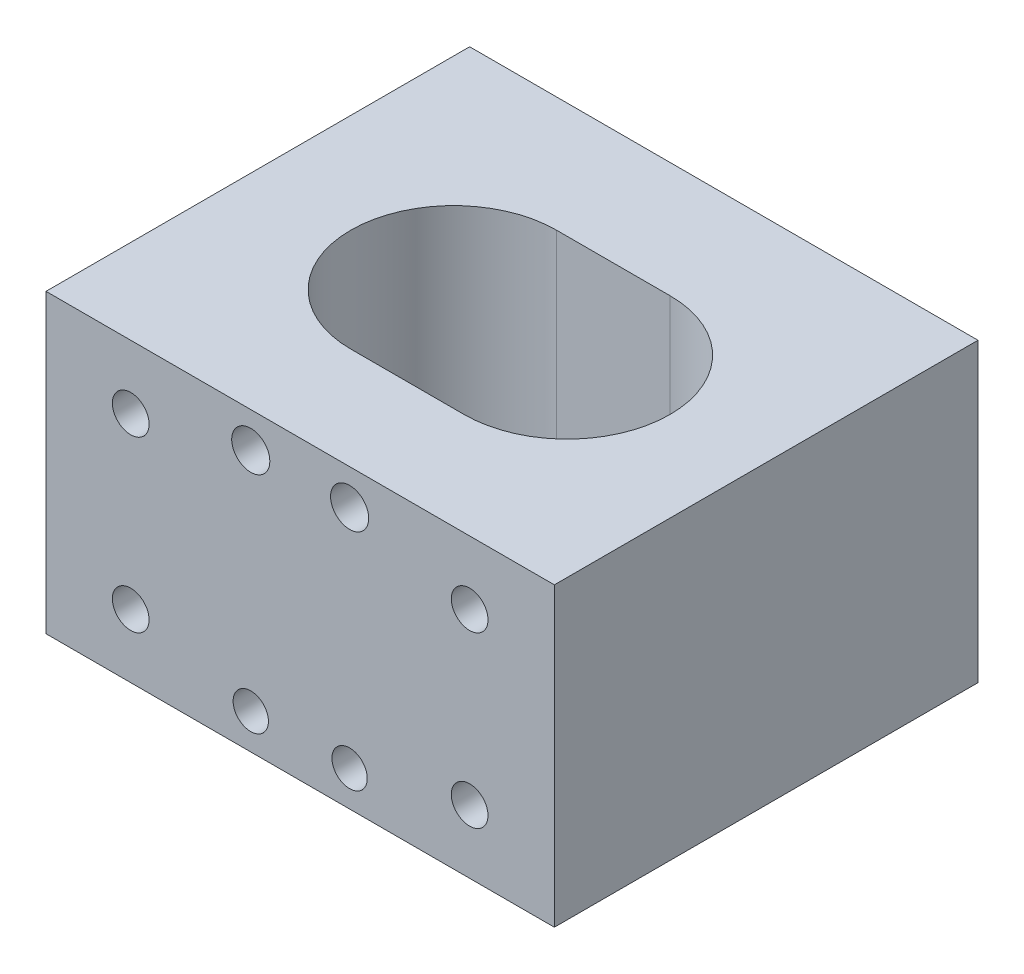
ISO-10303-21;
HEADER;
FILE_DESCRIPTION(('STEP AP214'),'2;1');
FILE_NAME('part.step','',(''),(''),'','','');
FILE_SCHEMA(('AUTOMOTIVE_DESIGN { 1 0 10303 214 1 1 1 1 }'));
ENDSEC;
DATA;
#1=APPLICATION_CONTEXT('core data for automotive mechanical design processes');
#2=APPLICATION_PROTOCOL_DEFINITION('international standard','automotive_design',2000,#1);
#3=PRODUCT_CONTEXT('',#1,'mechanical');
#4=PRODUCT('Part','Part','',(#3));
#5=PRODUCT_RELATED_PRODUCT_CATEGORY('part','',(#4));
#6=PRODUCT_DEFINITION_FORMATION('','',#4);
#7=PRODUCT_DEFINITION_CONTEXT('part definition',#1,'design');
#8=PRODUCT_DEFINITION('design','',#6,#7);
#9=PRODUCT_DEFINITION_SHAPE('','',#8);
#10=(LENGTH_UNIT() NAMED_UNIT(*) SI_UNIT(.MILLI.,.METRE.));
#11=(NAMED_UNIT(*) PLANE_ANGLE_UNIT() SI_UNIT($,.RADIAN.));
#12=(NAMED_UNIT(*) SI_UNIT($,.STERADIAN.) SOLID_ANGLE_UNIT());
#13=UNCERTAINTY_MEASURE_WITH_UNIT(LENGTH_MEASURE(1.E-05),#10,'distance_accuracy_value','');
#14=(GEOMETRIC_REPRESENTATION_CONTEXT(3) GLOBAL_UNCERTAINTY_ASSIGNED_CONTEXT((#13)) GLOBAL_UNIT_ASSIGNED_CONTEXT((#10,
#11,#12)) REPRESENTATION_CONTEXT('',''));
#15=CARTESIAN_POINT('',(0.,0.,0.));
#16=DIRECTION('',(0.,0.,1.));
#17=DIRECTION('',(1.,0.,0.));
#18=AXIS2_PLACEMENT_3D('',#15,#16,#17);
#19=CARTESIAN_POINT('',(0.,0.,0.));
#20=DIRECTION('',(0.,0.,1.));
#21=DIRECTION('',(1.,0.,0.));
#22=AXIS2_PLACEMENT_3D('',#19,#20,#21);
#23=PLANE('',#22);
#24=CARTESIAN_POINT('',(-3.5,-7.99999999999999,0.));
#25=DIRECTION('',(0.,0.,-1.));
#26=DIRECTION('',(-1.,0.,0.));
#27=AXIS2_PLACEMENT_3D('',#24,#25,#26);
#28=CIRCLE('',#27,1.25);
#29=CARTESIAN_POINT('',(-4.75,-7.99999999999999,0.));
#30=VERTEX_POINT('',#29);
#31=EDGE_CURVE('E195',#30,#30,#28,.T.);
#32=ORIENTED_EDGE('',*,*,#31,.F.);
#33=EDGE_LOOP('',(#32));
#34=FACE_BOUND('',#33,.T.);
#35=CARTESIAN_POINT('',(-12.,-5.99999999999999,0.));
#36=DIRECTION('',(0.,0.,1.));
#37=DIRECTION('',(1.,0.,0.));
#38=AXIS2_PLACEMENT_3D('',#35,#36,#37);
#39=CIRCLE('',#38,1.3);
#40=CARTESIAN_POINT('',(-10.7,-5.99999999999999,0.));
#41=VERTEX_POINT('',#40);
#42=EDGE_CURVE('E201',#41,#41,#39,.F.);
#43=ORIENTED_EDGE('',*,*,#42,.F.);
#44=EDGE_LOOP('',(#43));
#45=FACE_BOUND('',#44,.T.);
#46=CARTESIAN_POINT('',(-12.,6.,0.));
#47=DIRECTION('',(0.,0.,1.));
#48=DIRECTION('',(1.,0.,0.));
#49=AXIS2_PLACEMENT_3D('',#46,#47,#48);
#50=CIRCLE('',#49,1.3);
#51=CARTESIAN_POINT('',(-10.7,6.,0.));
#52=VERTEX_POINT('',#51);
#53=EDGE_CURVE('E207',#52,#52,#50,.F.);
#54=ORIENTED_EDGE('',*,*,#53,.F.);
#55=EDGE_LOOP('',(#54));
#56=FACE_BOUND('',#55,.T.);
#57=CARTESIAN_POINT('',(-3.5,8.,0.));
#58=DIRECTION('',(0.,0.,1.));
#59=DIRECTION('',(1.,0.,0.));
#60=AXIS2_PLACEMENT_3D('',#57,#58,#59);
#61=CIRCLE('',#60,1.35000000008995);
#62=CARTESIAN_POINT('',(-2.14999999991005,8.,0.));
#63=VERTEX_POINT('',#62);
#64=EDGE_CURVE('E213',#63,#63,#61,.F.);
#65=ORIENTED_EDGE('',*,*,#64,.F.);
#66=EDGE_LOOP('',(#65));
#67=FACE_BOUND('',#66,.T.);
#68=DIRECTION('',(0.,1.,0.));
#69=VECTOR('',#68,1.);
#70=CARTESIAN_POINT('',(-18.,0.,0.));
#71=LINE('',#70,#69);
#72=CARTESIAN_POINT('',(-18.,-10.5,0.));
#73=VERTEX_POINT('',#72);
#74=CARTESIAN_POINT('',(-18.,10.5,0.));
#75=VERTEX_POINT('',#74);
#76=EDGE_CURVE('E228',#73,#75,#71,.T.);
#77=ORIENTED_EDGE('',*,*,#76,.T.);
#78=DIRECTION('',(-1.,0.,0.));
#79=VECTOR('',#78,1.);
#80=CARTESIAN_POINT('',(0.,10.5,0.));
#81=LINE('',#80,#79);
#82=CARTESIAN_POINT('',(18.,10.5,0.));
#83=VERTEX_POINT('',#82);
#84=EDGE_CURVE('E235',#83,#75,#81,.T.);
#85=ORIENTED_EDGE('',*,*,#84,.F.);
#86=DIRECTION('',(0.,1.,0.));
#87=VECTOR('',#86,1.);
#88=CARTESIAN_POINT('',(18.,0.,0.));
#89=LINE('',#88,#87);
#90=CARTESIAN_POINT('',(18.,-10.5,0.));
#91=VERTEX_POINT('',#90);
#92=EDGE_CURVE('E248',#91,#83,#89,.T.);
#93=ORIENTED_EDGE('',*,*,#92,.F.);
#94=DIRECTION('',(-1.,0.,0.));
#95=VECTOR('',#94,1.);
#96=CARTESIAN_POINT('',(0.,-10.5,0.));
#97=LINE('',#96,#95);
#98=EDGE_CURVE('E245',#91,#73,#97,.T.);
#99=ORIENTED_EDGE('',*,*,#98,.T.);
#100=EDGE_LOOP('',(#77,#85,#93,#99));
#101=FACE_BOUND('',#100,.T.);
#102=CARTESIAN_POINT('',(12.,6.,0.));
#103=DIRECTION('',(0.,0.,1.));
#104=DIRECTION('',(1.,0.,0.));
#105=AXIS2_PLACEMENT_3D('',#102,#103,#104);
#106=CIRCLE('',#105,1.3);
#107=CARTESIAN_POINT('',(13.3,6.,0.));
#108=VERTEX_POINT('',#107);
#109=EDGE_CURVE('E222',#108,#108,#106,.T.);
#110=ORIENTED_EDGE('',*,*,#109,.T.);
#111=EDGE_LOOP('',(#110));
#112=FACE_BOUND('',#111,.T.);
#113=CARTESIAN_POINT('',(3.5,8.,0.));
#114=DIRECTION('',(0.,0.,1.));
#115=DIRECTION('',(1.,0.,0.));
#116=AXIS2_PLACEMENT_3D('',#113,#114,#115);
#117=CIRCLE('',#116,1.35000000008995);
#118=CARTESIAN_POINT('',(4.85000000008995,8.,0.));
#119=VERTEX_POINT('',#118);
#120=EDGE_CURVE('E219',#119,#119,#117,.T.);
#121=ORIENTED_EDGE('',*,*,#120,.T.);
#122=EDGE_LOOP('',(#121));
#123=FACE_BOUND('',#122,.T.);
#124=CARTESIAN_POINT('',(3.5,-8.,0.));
#125=DIRECTION('',(0.,0.,1.));
#126=DIRECTION('',(1.,0.,0.));
#127=AXIS2_PLACEMENT_3D('',#124,#125,#126);
#128=CIRCLE('',#127,1.25);
#129=CARTESIAN_POINT('',(4.75,-8.,0.));
#130=VERTEX_POINT('',#129);
#131=EDGE_CURVE('E189',#130,#130,#128,.T.);
#132=ORIENTED_EDGE('',*,*,#131,.T.);
#133=EDGE_LOOP('',(#132));
#134=FACE_BOUND('',#133,.T.);
#135=CARTESIAN_POINT('',(12.,-6.,0.));
#136=DIRECTION('',(0.,0.,1.));
#137=DIRECTION('',(1.,0.,0.));
#138=AXIS2_PLACEMENT_3D('',#135,#136,#137);
#139=CIRCLE('',#138,1.3);
#140=CARTESIAN_POINT('',(13.3,-6.,0.));
#141=VERTEX_POINT('',#140);
#142=EDGE_CURVE('E183',#141,#141,#139,.T.);
#143=ORIENTED_EDGE('',*,*,#142,.T.);
#144=EDGE_LOOP('',(#143));
#145=FACE_BOUND('',#144,.T.);
#146=ADVANCED_FACE('F34',(#34,#45,#56,#67,#101,#112,#123,#134,#145),#23,.F.);
#147=CARTESIAN_POINT('',(-18.,0.,30.));
#148=DIRECTION('',(-1.,0.,0.));
#149=DIRECTION('',(0.,0.,1.));
#150=AXIS2_PLACEMENT_3D('',#147,#148,#149);
#151=PLANE('',#150);
#152=ORIENTED_EDGE('',*,*,#76,.F.);
#153=DIRECTION('',(0.,0.,-1.));
#154=VECTOR('',#153,1.);
#155=CARTESIAN_POINT('',(-18.,-10.5,30.));
#156=LINE('',#155,#154);
#157=CARTESIAN_POINT('',(-18.,-10.5,30.));
#158=VERTEX_POINT('',#157);
#159=EDGE_CURVE('E11',#158,#73,#156,.T.);
#160=ORIENTED_EDGE('',*,*,#159,.F.);
#161=DIRECTION('',(0.,1.,0.));
#162=VECTOR('',#161,1.);
#163=CARTESIAN_POINT('',(-18.,0.,30.));
#164=LINE('',#163,#162);
#165=CARTESIAN_POINT('',(-18.,10.5,30.));
#166=VERTEX_POINT('',#165);
#167=EDGE_CURVE('E231',#158,#166,#164,.T.);
#168=ORIENTED_EDGE('',*,*,#167,.T.);
#169=DIRECTION('',(0.,0.,-1.));
#170=VECTOR('',#169,1.);
#171=CARTESIAN_POINT('',(-18.,10.5,30.));
#172=LINE('',#171,#170);
#173=EDGE_CURVE('E242',#166,#75,#172,.T.);
#174=ORIENTED_EDGE('',*,*,#173,.T.);
#175=EDGE_LOOP('',(#152,#160,#168,#174));
#176=FACE_BOUND('',#175,.T.);
#177=ADVANCED_FACE('F36',(#176),#151,.T.);
#178=CARTESIAN_POINT('',(0.,-10.5,30.));
#179=DIRECTION('',(0.,-1.,0.));
#180=DIRECTION('',(0.,0.,-1.));
#181=AXIS2_PLACEMENT_3D('',#178,#179,#180);
#182=PLANE('',#181);
#183=CARTESIAN_POINT('',(-3.67191189621963,-10.5,15.4612886839729));
#184=DIRECTION('',(0.,-1.,0.));
#185=DIRECTION('',(0.,0.,-1.));
#186=AXIS2_PLACEMENT_3D('',#183,#184,#185);
#187=CIRCLE('',#186,7.28899789248771);
#188=CARTESIAN_POINT('',(-3.67191189621963,-10.5,22.7502865764606));
#189=VERTEX_POINT('',#188);
#190=CARTESIAN_POINT('',(-3.67191189621963,-10.5,8.17229079148518));
#191=VERTEX_POINT('',#190);
#192=EDGE_CURVE('E132',#189,#191,#187,.T.);
#193=ORIENTED_EDGE('',*,*,#192,.F.);
#194=DIRECTION('',(-1.,0.,0.));
#195=VECTOR('',#194,1.);
#196=CARTESIAN_POINT('',(0.,-10.5,22.7502865764606));
#197=LINE('',#196,#195);
#198=CARTESIAN_POINT('',(4.36058603034439,-10.5,22.7502865764606));
#199=VERTEX_POINT('',#198);
#200=EDGE_CURVE('E124',#199,#189,#197,.T.);
#201=ORIENTED_EDGE('',*,*,#200,.F.);
#202=CARTESIAN_POINT('',(4.36058603034439,-10.5,15.4612886839729));
#203=DIRECTION('',(0.,-1.,0.));
#204=DIRECTION('',(0.,0.,-1.));
#205=AXIS2_PLACEMENT_3D('',#202,#203,#204);
#206=CIRCLE('',#205,7.28899789248771);
#207=CARTESIAN_POINT('',(4.36058603034439,-10.5,8.17229079148518));
#208=VERTEX_POINT('',#207);
#209=EDGE_CURVE('E104',#208,#199,#206,.T.);
#210=ORIENTED_EDGE('',*,*,#209,.F.);
#211=DIRECTION('',(-1.,0.,0.));
#212=VECTOR('',#211,1.);
#213=CARTESIAN_POINT('',(0.,-10.5,8.17229079148518));
#214=LINE('',#213,#212);
#215=EDGE_CURVE('E129',#208,#191,#214,.T.);
#216=ORIENTED_EDGE('',*,*,#215,.T.);
#217=EDGE_LOOP('',(#193,#201,#210,#216));
#218=FACE_BOUND('',#217,.T.);
#219=ORIENTED_EDGE('',*,*,#98,.F.);
#220=DIRECTION('',(0.,0.,-1.));
#221=VECTOR('',#220,1.);
#222=CARTESIAN_POINT('',(18.,-10.5,30.));
#223=LINE('',#222,#221);
#224=CARTESIAN_POINT('',(18.,-10.5,30.));
#225=VERTEX_POINT('',#224);
#226=EDGE_CURVE('E42',#225,#91,#223,.T.);
#227=ORIENTED_EDGE('',*,*,#226,.F.);
#228=DIRECTION('',(-1.,0.,0.));
#229=VECTOR('',#228,1.);
#230=CARTESIAN_POINT('',(0.,-10.5,30.));
#231=LINE('',#230,#229);
#232=EDGE_CURVE('E234',#225,#158,#231,.T.);
#233=ORIENTED_EDGE('',*,*,#232,.T.);
#234=ORIENTED_EDGE('',*,*,#159,.T.);
#235=EDGE_LOOP('',(#219,#227,#233,#234));
#236=FACE_BOUND('',#235,.T.);
#237=ADVANCED_FACE('F266',(#218,#236),#182,.T.);
#238=CARTESIAN_POINT('',(18.,0.,30.));
#239=DIRECTION('',(-1.,0.,0.));
#240=DIRECTION('',(0.,0.,1.));
#241=AXIS2_PLACEMENT_3D('',#238,#239,#240);
#242=PLANE('',#241);
#243=ORIENTED_EDGE('',*,*,#92,.T.);
#244=DIRECTION('',(0.,0.,-1.));
#245=VECTOR('',#244,1.);
#246=CARTESIAN_POINT('',(18.,10.5,30.));
#247=LINE('',#246,#245);
#248=CARTESIAN_POINT('',(18.,10.5,30.));
#249=VERTEX_POINT('',#248);
#250=EDGE_CURVE('E253',#249,#83,#247,.T.);
#251=ORIENTED_EDGE('',*,*,#250,.F.);
#252=DIRECTION('',(0.,1.,0.));
#253=VECTOR('',#252,1.);
#254=CARTESIAN_POINT('',(18.,0.,30.));
#255=LINE('',#254,#253);
#256=EDGE_CURVE('E238',#225,#249,#255,.T.);
#257=ORIENTED_EDGE('',*,*,#256,.F.);
#258=ORIENTED_EDGE('',*,*,#226,.T.);
#259=EDGE_LOOP('',(#243,#251,#257,#258));
#260=FACE_BOUND('',#259,.T.);
#261=ADVANCED_FACE('F258',(#260),#242,.F.);
#262=CARTESIAN_POINT('',(0.,10.5,30.));
#263=DIRECTION('',(0.,-1.,0.));
#264=DIRECTION('',(0.,0.,-1.));
#265=AXIS2_PLACEMENT_3D('',#262,#263,#264);
#266=PLANE('',#265);
#267=DIRECTION('',(1.,0.,0.));
#268=VECTOR('',#267,1.);
#269=CARTESIAN_POINT('',(-3.67191189621963,10.5,22.7502865764606));
#270=LINE('',#269,#268);
#271=CARTESIAN_POINT('',(-3.67191189621963,10.5,22.7502865764606));
#272=VERTEX_POINT('',#271);
#273=CARTESIAN_POINT('',(4.36058603034439,10.5,22.7502865764606));
#274=VERTEX_POINT('',#273);
#275=EDGE_CURVE('E110',#272,#274,#270,.T.);
#276=ORIENTED_EDGE('',*,*,#275,.F.);
#277=CARTESIAN_POINT('',(-3.67191189621963,10.5,15.4612886839729));
#278=DIRECTION('',(0.,1.,0.));
#279=DIRECTION('',(0.,0.,1.));
#280=AXIS2_PLACEMENT_3D('',#277,#278,#279);
#281=CIRCLE('',#280,7.28899789248771);
#282=CARTESIAN_POINT('',(-3.67191189621963,10.5,8.17229079148518));
#283=VERTEX_POINT('',#282);
#284=EDGE_CURVE('E57',#283,#272,#281,.T.);
#285=ORIENTED_EDGE('',*,*,#284,.F.);
#286=DIRECTION('',(1.,0.,0.));
#287=VECTOR('',#286,1.);
#288=CARTESIAN_POINT('',(-3.67191189621963,10.5,8.17229079148518));
#289=LINE('',#288,#287);
#290=CARTESIAN_POINT('',(4.36058603034439,10.5,8.17229079148518));
#291=VERTEX_POINT('',#290);
#292=EDGE_CURVE('E117',#283,#291,#289,.T.);
#293=ORIENTED_EDGE('',*,*,#292,.T.);
#294=CARTESIAN_POINT('',(4.36058603034439,10.5,15.4612886839729));
#295=DIRECTION('',(0.,1.,0.));
#296=DIRECTION('',(0.,0.,1.));
#297=AXIS2_PLACEMENT_3D('',#294,#295,#296);
#298=CIRCLE('',#297,7.28899789248771);
#299=EDGE_CURVE('E101',#274,#291,#298,.T.);
#300=ORIENTED_EDGE('',*,*,#299,.F.);
#301=EDGE_LOOP('',(#276,#285,#293,#300));
#302=FACE_BOUND('',#301,.T.);
#303=ORIENTED_EDGE('',*,*,#84,.T.);
#304=ORIENTED_EDGE('',*,*,#173,.F.);
#305=DIRECTION('',(-1.,0.,0.));
#306=VECTOR('',#305,1.);
#307=CARTESIAN_POINT('',(0.,10.5,30.));
#308=LINE('',#307,#306);
#309=EDGE_CURVE('E240',#249,#166,#308,.T.);
#310=ORIENTED_EDGE('',*,*,#309,.F.);
#311=ORIENTED_EDGE('',*,*,#250,.T.);
#312=EDGE_LOOP('',(#303,#304,#310,#311));
#313=FACE_BOUND('',#312,.T.);
#314=ADVANCED_FACE('F114',(#302,#313),#266,.F.);
#315=CARTESIAN_POINT('',(0.,0.,30.));
#316=DIRECTION('',(0.,0.,1.));
#317=DIRECTION('',(1.,0.,0.));
#318=AXIS2_PLACEMENT_3D('',#315,#316,#317);
#319=PLANE('',#318);
#320=CARTESIAN_POINT('',(12.,-6.,30.));
#321=DIRECTION('',(0.,0.,1.));
#322=DIRECTION('',(1.,0.,0.));
#323=AXIS2_PLACEMENT_3D('',#320,#321,#322);
#324=CIRCLE('',#323,1.3);
#325=CARTESIAN_POINT('',(13.3,-6.,30.));
#326=VERTEX_POINT('',#325);
#327=EDGE_CURVE('E134',#326,#326,#324,.T.);
#328=ORIENTED_EDGE('',*,*,#327,.F.);
#329=EDGE_LOOP('',(#328));
#330=FACE_BOUND('',#329,.T.);
#331=CARTESIAN_POINT('',(3.5,-8.,30.));
#332=DIRECTION('',(0.,0.,1.));
#333=DIRECTION('',(1.,0.,0.));
#334=AXIS2_PLACEMENT_3D('',#331,#332,#333);
#335=CIRCLE('',#334,1.25);
#336=CARTESIAN_POINT('',(4.75,-8.,30.));
#337=VERTEX_POINT('',#336);
#338=EDGE_CURVE('E138',#337,#337,#335,.T.);
#339=ORIENTED_EDGE('',*,*,#338,.F.);
#340=EDGE_LOOP('',(#339));
#341=FACE_BOUND('',#340,.T.);
#342=CARTESIAN_POINT('',(-3.5,-7.99999999999999,30.));
#343=DIRECTION('',(0.,0.,1.));
#344=DIRECTION('',(1.,0.,0.));
#345=AXIS2_PLACEMENT_3D('',#342,#343,#344);
#346=CIRCLE('',#345,1.25);
#347=CARTESIAN_POINT('',(-2.25,-7.99999999999999,30.));
#348=VERTEX_POINT('',#347);
#349=EDGE_CURVE('E144',#348,#348,#346,.T.);
#350=ORIENTED_EDGE('',*,*,#349,.F.);
#351=EDGE_LOOP('',(#350));
#352=FACE_BOUND('',#351,.T.);
#353=CARTESIAN_POINT('',(-12.,-5.99999999999999,30.));
#354=DIRECTION('',(0.,0.,1.));
#355=DIRECTION('',(1.,0.,0.));
#356=AXIS2_PLACEMENT_3D('',#353,#354,#355);
#357=CIRCLE('',#356,1.3);
#358=CARTESIAN_POINT('',(-10.7,-5.99999999999999,30.));
#359=VERTEX_POINT('',#358);
#360=EDGE_CURVE('E150',#359,#359,#357,.T.);
#361=ORIENTED_EDGE('',*,*,#360,.F.);
#362=EDGE_LOOP('',(#361));
#363=FACE_BOUND('',#362,.T.);
#364=CARTESIAN_POINT('',(-12.,6.,30.));
#365=DIRECTION('',(0.,0.,1.));
#366=DIRECTION('',(1.,0.,0.));
#367=AXIS2_PLACEMENT_3D('',#364,#365,#366);
#368=CIRCLE('',#367,1.3);
#369=CARTESIAN_POINT('',(-10.7,6.,30.));
#370=VERTEX_POINT('',#369);
#371=EDGE_CURVE('E156',#370,#370,#368,.T.);
#372=ORIENTED_EDGE('',*,*,#371,.F.);
#373=EDGE_LOOP('',(#372));
#374=FACE_BOUND('',#373,.T.);
#375=CARTESIAN_POINT('',(-3.5,8.,30.));
#376=DIRECTION('',(0.,0.,1.));
#377=DIRECTION('',(1.,0.,0.));
#378=AXIS2_PLACEMENT_3D('',#375,#376,#377);
#379=CIRCLE('',#378,1.35000000008995);
#380=CARTESIAN_POINT('',(-2.14999999991005,8.,30.));
#381=VERTEX_POINT('',#380);
#382=EDGE_CURVE('E162',#381,#381,#379,.T.);
#383=ORIENTED_EDGE('',*,*,#382,.F.);
#384=EDGE_LOOP('',(#383));
#385=FACE_BOUND('',#384,.T.);
#386=CARTESIAN_POINT('',(12.,6.,30.));
#387=DIRECTION('',(0.,0.,1.));
#388=DIRECTION('',(1.,0.,0.));
#389=AXIS2_PLACEMENT_3D('',#386,#387,#388);
#390=CIRCLE('',#389,1.3);
#391=CARTESIAN_POINT('',(13.3,6.,30.));
#392=VERTEX_POINT('',#391);
#393=EDGE_CURVE('E168',#392,#392,#390,.T.);
#394=ORIENTED_EDGE('',*,*,#393,.F.);
#395=EDGE_LOOP('',(#394));
#396=FACE_BOUND('',#395,.T.);
#397=CARTESIAN_POINT('',(3.5,8.,30.));
#398=DIRECTION('',(0.,0.,1.));
#399=DIRECTION('',(1.,0.,0.));
#400=AXIS2_PLACEMENT_3D('',#397,#398,#399);
#401=CIRCLE('',#400,1.35000000008995);
#402=CARTESIAN_POINT('',(4.85000000008995,8.,30.));
#403=VERTEX_POINT('',#402);
#404=EDGE_CURVE('E174',#403,#403,#401,.T.);
#405=ORIENTED_EDGE('',*,*,#404,.F.);
#406=EDGE_LOOP('',(#405));
#407=FACE_BOUND('',#406,.T.);
#408=ORIENTED_EDGE('',*,*,#167,.F.);
#409=ORIENTED_EDGE('',*,*,#232,.F.);
#410=ORIENTED_EDGE('',*,*,#256,.T.);
#411=ORIENTED_EDGE('',*,*,#309,.T.);
#412=EDGE_LOOP('',(#408,#409,#410,#411));
#413=FACE_BOUND('',#412,.T.);
#414=ADVANCED_FACE('F273',(#330,#341,#352,#363,#374,#385,#396,#407,#413),#319,.T.);
#415=CARTESIAN_POINT('',(12.,6.,4.));
#416=DIRECTION('',(0.,0.,-1.));
#417=DIRECTION('',(-1.,0.,0.));
#418=AXIS2_PLACEMENT_3D('',#415,#416,#417);
#419=CYLINDRICAL_SURFACE('',#418,1.3);
#420=CARTESIAN_POINT('',(12.,6.,4.));
#421=DIRECTION('',(0.,0.,1.));
#422=DIRECTION('',(1.,0.,0.));
#423=AXIS2_PLACEMENT_3D('',#420,#421,#422);
#424=CIRCLE('',#423,1.3);
#425=CARTESIAN_POINT('',(13.3,6.,4.));
#426=VERTEX_POINT('',#425);
#427=EDGE_CURVE('E225',#426,#426,#424,.T.);
#428=ORIENTED_EDGE('',*,*,#427,.T.);
#429=EDGE_LOOP('',(#428));
#430=FACE_BOUND('',#429,.T.);
#431=ORIENTED_EDGE('',*,*,#109,.F.);
#432=EDGE_LOOP('',(#431));
#433=FACE_BOUND('',#432,.T.);
#434=ADVANCED_FACE('F275',(#430,#433),#419,.F.);
#435=CARTESIAN_POINT('',(0.,0.,4.));
#436=DIRECTION('',(0.,0.,1.));
#437=DIRECTION('',(1.,0.,0.));
#438=AXIS2_PLACEMENT_3D('',#435,#436,#437);
#439=PLANE('',#438);
#440=ORIENTED_EDGE('',*,*,#427,.F.);
#441=EDGE_LOOP('',(#440));
#442=FACE_BOUND('',#441,.T.);
#443=ADVANCED_FACE('F282',(#442),#439,.F.);
#444=CARTESIAN_POINT('',(3.5,8.,4.));
#445=DIRECTION('',(0.,0.,-1.));
#446=DIRECTION('',(-1.,0.,0.));
#447=AXIS2_PLACEMENT_3D('',#444,#445,#446);
#448=CYLINDRICAL_SURFACE('',#447,1.35000000008995);
#449=CARTESIAN_POINT('',(3.5,8.,4.));
#450=DIRECTION('',(0.,0.,1.));
#451=DIRECTION('',(1.,0.,0.));
#452=AXIS2_PLACEMENT_3D('',#449,#450,#451);
#453=CIRCLE('',#452,1.35000000008995);
#454=CARTESIAN_POINT('',(4.85000000008995,8.,4.));
#455=VERTEX_POINT('',#454);
#456=EDGE_CURVE('E216',#455,#455,#453,.T.);
#457=ORIENTED_EDGE('',*,*,#456,.T.);
#458=EDGE_LOOP('',(#457));
#459=FACE_BOUND('',#458,.T.);
#460=ORIENTED_EDGE('',*,*,#120,.F.);
#461=EDGE_LOOP('',(#460));
#462=FACE_BOUND('',#461,.T.);
#463=ADVANCED_FACE('F431',(#459,#462),#448,.F.);
#464=CARTESIAN_POINT('',(0.,0.,4.));
#465=DIRECTION('',(0.,0.,1.));
#466=DIRECTION('',(1.,0.,0.));
#467=AXIS2_PLACEMENT_3D('',#464,#465,#466);
#468=PLANE('',#467);
#469=ORIENTED_EDGE('',*,*,#456,.F.);
#470=EDGE_LOOP('',(#469));
#471=FACE_BOUND('',#470,.T.);
#472=ADVANCED_FACE('F426',(#471),#468,.F.);
#473=CARTESIAN_POINT('',(-3.5,8.,4.));
#474=DIRECTION('',(0.,0.,-1.));
#475=DIRECTION('',(-1.,0.,0.));
#476=AXIS2_PLACEMENT_3D('',#473,#474,#475);
#477=CYLINDRICAL_SURFACE('',#476,1.35000000008995);
#478=CARTESIAN_POINT('',(-3.5,8.,4.));
#479=DIRECTION('',(0.,0.,1.));
#480=DIRECTION('',(1.,0.,0.));
#481=AXIS2_PLACEMENT_3D('',#478,#479,#480);
#482=CIRCLE('',#481,1.35000000008995);
#483=CARTESIAN_POINT('',(-2.14999999991005,8.,4.));
#484=VERTEX_POINT('',#483);
#485=EDGE_CURVE('E210',#484,#484,#482,.F.);
#486=ORIENTED_EDGE('',*,*,#485,.F.);
#487=EDGE_LOOP('',(#486));
#488=FACE_BOUND('',#487,.T.);
#489=ORIENTED_EDGE('',*,*,#64,.T.);
#490=EDGE_LOOP('',(#489));
#491=FACE_BOUND('',#490,.T.);
#492=ADVANCED_FACE('F423',(#488,#491),#477,.F.);
#493=CARTESIAN_POINT('',(0.,0.,4.));
#494=DIRECTION('',(0.,0.,1.));
#495=DIRECTION('',(1.,0.,0.));
#496=AXIS2_PLACEMENT_3D('',#493,#494,#495);
#497=PLANE('',#496);
#498=ORIENTED_EDGE('',*,*,#485,.T.);
#499=EDGE_LOOP('',(#498));
#500=FACE_BOUND('',#499,.T.);
#501=ADVANCED_FACE('F418',(#500),#497,.F.);
#502=CARTESIAN_POINT('',(-12.,6.,4.));
#503=DIRECTION('',(0.,0.,-1.));
#504=DIRECTION('',(-1.,0.,0.));
#505=AXIS2_PLACEMENT_3D('',#502,#503,#504);
#506=CYLINDRICAL_SURFACE('',#505,1.3);
#507=CARTESIAN_POINT('',(-12.,6.,4.));
#508=DIRECTION('',(0.,0.,1.));
#509=DIRECTION('',(1.,0.,0.));
#510=AXIS2_PLACEMENT_3D('',#507,#508,#509);
#511=CIRCLE('',#510,1.3);
#512=CARTESIAN_POINT('',(-10.7,6.,4.));
#513=VERTEX_POINT('',#512);
#514=EDGE_CURVE('E204',#513,#513,#511,.F.);
#515=ORIENTED_EDGE('',*,*,#514,.F.);
#516=EDGE_LOOP('',(#515));
#517=FACE_BOUND('',#516,.T.);
#518=ORIENTED_EDGE('',*,*,#53,.T.);
#519=EDGE_LOOP('',(#518));
#520=FACE_BOUND('',#519,.T.);
#521=ADVANCED_FACE('F415',(#517,#520),#506,.F.);
#522=CARTESIAN_POINT('',(0.,0.,4.));
#523=DIRECTION('',(0.,0.,1.));
#524=DIRECTION('',(1.,0.,0.));
#525=AXIS2_PLACEMENT_3D('',#522,#523,#524);
#526=PLANE('',#525);
#527=ORIENTED_EDGE('',*,*,#514,.T.);
#528=EDGE_LOOP('',(#527));
#529=FACE_BOUND('',#528,.T.);
#530=ADVANCED_FACE('F410',(#529),#526,.F.);
#531=CARTESIAN_POINT('',(-12.,-5.99999999999999,4.));
#532=DIRECTION('',(0.,0.,-1.));
#533=DIRECTION('',(-1.,0.,0.));
#534=AXIS2_PLACEMENT_3D('',#531,#532,#533);
#535=CYLINDRICAL_SURFACE('',#534,1.3);
#536=CARTESIAN_POINT('',(-12.,-5.99999999999999,4.));
#537=DIRECTION('',(0.,0.,1.));
#538=DIRECTION('',(1.,0.,0.));
#539=AXIS2_PLACEMENT_3D('',#536,#537,#538);
#540=CIRCLE('',#539,1.3);
#541=CARTESIAN_POINT('',(-10.7,-5.99999999999999,4.));
#542=VERTEX_POINT('',#541);
#543=EDGE_CURVE('E198',#542,#542,#540,.F.);
#544=ORIENTED_EDGE('',*,*,#543,.F.);
#545=EDGE_LOOP('',(#544));
#546=FACE_BOUND('',#545,.T.);
#547=ORIENTED_EDGE('',*,*,#42,.T.);
#548=EDGE_LOOP('',(#547));
#549=FACE_BOUND('',#548,.T.);
#550=ADVANCED_FACE('F407',(#546,#549),#535,.F.);
#551=CARTESIAN_POINT('',(0.,0.,4.));
#552=DIRECTION('',(0.,0.,1.));
#553=DIRECTION('',(1.,0.,0.));
#554=AXIS2_PLACEMENT_3D('',#551,#552,#553);
#555=PLANE('',#554);
#556=ORIENTED_EDGE('',*,*,#543,.T.);
#557=EDGE_LOOP('',(#556));
#558=FACE_BOUND('',#557,.T.);
#559=ADVANCED_FACE('F402',(#558),#555,.F.);
#560=CARTESIAN_POINT('',(-3.5,-7.99999999999999,4.));
#561=DIRECTION('',(0.,0.,-1.));
#562=DIRECTION('',(-1.,0.,0.));
#563=AXIS2_PLACEMENT_3D('',#560,#561,#562);
#564=CYLINDRICAL_SURFACE('',#563,1.25);
#565=CARTESIAN_POINT('',(-3.5,-7.99999999999999,4.));
#566=DIRECTION('',(0.,0.,-1.));
#567=DIRECTION('',(-1.,0.,0.));
#568=AXIS2_PLACEMENT_3D('',#565,#566,#567);
#569=CIRCLE('',#568,1.25);
#570=CARTESIAN_POINT('',(-4.75,-7.99999999999999,4.));
#571=VERTEX_POINT('',#570);
#572=EDGE_CURVE('E192',#571,#571,#569,.T.);
#573=ORIENTED_EDGE('',*,*,#572,.F.);
#574=EDGE_LOOP('',(#573));
#575=FACE_BOUND('',#574,.T.);
#576=ORIENTED_EDGE('',*,*,#31,.T.);
#577=EDGE_LOOP('',(#576));
#578=FACE_BOUND('',#577,.T.);
#579=ADVANCED_FACE('F399',(#575,#578),#564,.F.);
#580=CARTESIAN_POINT('',(-3.5,-7.99999999999999,4.));
#581=DIRECTION('',(0.,0.,-1.));
#582=DIRECTION('',(-1.,0.,0.));
#583=AXIS2_PLACEMENT_3D('',#580,#581,#582);
#584=PLANE('',#583);
#585=ORIENTED_EDGE('',*,*,#572,.T.);
#586=EDGE_LOOP('',(#585));
#587=FACE_BOUND('',#586,.T.);
#588=ADVANCED_FACE('F394',(#587),#584,.T.);
#589=CARTESIAN_POINT('',(3.5,-8.,4.));
#590=DIRECTION('',(0.,0.,-1.));
#591=DIRECTION('',(-1.,0.,0.));
#592=AXIS2_PLACEMENT_3D('',#589,#590,#591);
#593=CYLINDRICAL_SURFACE('',#592,1.25);
#594=CARTESIAN_POINT('',(3.5,-8.,4.));
#595=DIRECTION('',(0.,0.,1.));
#596=DIRECTION('',(1.,0.,0.));
#597=AXIS2_PLACEMENT_3D('',#594,#595,#596);
#598=CIRCLE('',#597,1.25);
#599=CARTESIAN_POINT('',(4.75,-8.,4.));
#600=VERTEX_POINT('',#599);
#601=EDGE_CURVE('E186',#600,#600,#598,.T.);
#602=ORIENTED_EDGE('',*,*,#601,.T.);
#603=EDGE_LOOP('',(#602));
#604=FACE_BOUND('',#603,.T.);
#605=ORIENTED_EDGE('',*,*,#131,.F.);
#606=EDGE_LOOP('',(#605));
#607=FACE_BOUND('',#606,.T.);
#608=ADVANCED_FACE('F391',(#604,#607),#593,.F.);
#609=CARTESIAN_POINT('',(3.5,-8.,4.));
#610=DIRECTION('',(0.,0.,1.));
#611=DIRECTION('',(1.,0.,0.));
#612=AXIS2_PLACEMENT_3D('',#609,#610,#611);
#613=PLANE('',#612);
#614=ORIENTED_EDGE('',*,*,#601,.F.);
#615=EDGE_LOOP('',(#614));
#616=FACE_BOUND('',#615,.T.);
#617=ADVANCED_FACE('F386',(#616),#613,.F.);
#618=CARTESIAN_POINT('',(12.,-6.,4.));
#619=DIRECTION('',(0.,0.,-1.));
#620=DIRECTION('',(-1.,0.,0.));
#621=AXIS2_PLACEMENT_3D('',#618,#619,#620);
#622=CYLINDRICAL_SURFACE('',#621,1.3);
#623=CARTESIAN_POINT('',(12.,-6.,4.));
#624=DIRECTION('',(0.,0.,1.));
#625=DIRECTION('',(1.,0.,0.));
#626=AXIS2_PLACEMENT_3D('',#623,#624,#625);
#627=CIRCLE('',#626,1.3);
#628=CARTESIAN_POINT('',(13.3,-6.,4.));
#629=VERTEX_POINT('',#628);
#630=EDGE_CURVE('E180',#629,#629,#627,.T.);
#631=ORIENTED_EDGE('',*,*,#630,.T.);
#632=EDGE_LOOP('',(#631));
#633=FACE_BOUND('',#632,.T.);
#634=ORIENTED_EDGE('',*,*,#142,.F.);
#635=EDGE_LOOP('',(#634));
#636=FACE_BOUND('',#635,.T.);
#637=ADVANCED_FACE('F383',(#633,#636),#622,.F.);
#638=CARTESIAN_POINT('',(12.,-6.,4.));
#639=DIRECTION('',(0.,0.,1.));
#640=DIRECTION('',(1.,0.,0.));
#641=AXIS2_PLACEMENT_3D('',#638,#639,#640);
#642=PLANE('',#641);
#643=ORIENTED_EDGE('',*,*,#630,.F.);
#644=EDGE_LOOP('',(#643));
#645=FACE_BOUND('',#644,.T.);
#646=ADVANCED_FACE('F381',(#645),#642,.F.);
#647=CARTESIAN_POINT('',(3.5,8.,26.));
#648=DIRECTION('',(0.,0.,1.));
#649=DIRECTION('',(1.,0.,0.));
#650=AXIS2_PLACEMENT_3D('',#647,#648,#649);
#651=CYLINDRICAL_SURFACE('',#650,1.35000000008995);
#652=CARTESIAN_POINT('',(3.5,8.,26.));
#653=DIRECTION('',(0.,0.,1.));
#654=DIRECTION('',(1.,0.,0.));
#655=AXIS2_PLACEMENT_3D('',#652,#653,#654);
#656=CIRCLE('',#655,1.35000000008995);
#657=CARTESIAN_POINT('',(4.85000000008995,8.,26.));
#658=VERTEX_POINT('',#657);
#659=EDGE_CURVE('E177',#658,#658,#656,.T.);
#660=ORIENTED_EDGE('',*,*,#659,.F.);
#661=EDGE_LOOP('',(#660));
#662=FACE_BOUND('',#661,.T.);
#663=ORIENTED_EDGE('',*,*,#404,.T.);
#664=EDGE_LOOP('',(#663));
#665=FACE_BOUND('',#664,.T.);
#666=ADVANCED_FACE('F377',(#662,#665),#651,.F.);
#667=CARTESIAN_POINT('',(3.5,8.,26.));
#668=DIRECTION('',(0.,0.,1.));
#669=DIRECTION('',(1.,0.,0.));
#670=AXIS2_PLACEMENT_3D('',#667,#668,#669);
#671=PLANE('',#670);
#672=ORIENTED_EDGE('',*,*,#659,.T.);
#673=EDGE_LOOP('',(#672));
#674=FACE_BOUND('',#673,.T.);
#675=ADVANCED_FACE('F373',(#674),#671,.T.);
#676=CARTESIAN_POINT('',(12.,6.,26.));
#677=DIRECTION('',(0.,0.,1.));
#678=DIRECTION('',(1.,0.,0.));
#679=AXIS2_PLACEMENT_3D('',#676,#677,#678);
#680=CYLINDRICAL_SURFACE('',#679,1.3);
#681=CARTESIAN_POINT('',(12.,6.,26.));
#682=DIRECTION('',(0.,0.,1.));
#683=DIRECTION('',(1.,0.,0.));
#684=AXIS2_PLACEMENT_3D('',#681,#682,#683);
#685=CIRCLE('',#684,1.3);
#686=CARTESIAN_POINT('',(13.3,6.,26.));
#687=VERTEX_POINT('',#686);
#688=EDGE_CURVE('E171',#687,#687,#685,.T.);
#689=ORIENTED_EDGE('',*,*,#688,.F.);
#690=EDGE_LOOP('',(#689));
#691=FACE_BOUND('',#690,.T.);
#692=ORIENTED_EDGE('',*,*,#393,.T.);
#693=EDGE_LOOP('',(#692));
#694=FACE_BOUND('',#693,.T.);
#695=ADVANCED_FACE('F369',(#691,#694),#680,.F.);
#696=CARTESIAN_POINT('',(12.,6.,26.));
#697=DIRECTION('',(0.,0.,1.));
#698=DIRECTION('',(1.,0.,0.));
#699=AXIS2_PLACEMENT_3D('',#696,#697,#698);
#700=PLANE('',#699);
#701=ORIENTED_EDGE('',*,*,#688,.T.);
#702=EDGE_LOOP('',(#701));
#703=FACE_BOUND('',#702,.T.);
#704=ADVANCED_FACE('F365',(#703),#700,.T.);
#705=CARTESIAN_POINT('',(-3.5,8.,26.));
#706=DIRECTION('',(0.,0.,1.));
#707=DIRECTION('',(1.,0.,0.));
#708=AXIS2_PLACEMENT_3D('',#705,#706,#707);
#709=CYLINDRICAL_SURFACE('',#708,1.35000000008995);
#710=CARTESIAN_POINT('',(-3.5,8.,26.));
#711=DIRECTION('',(0.,0.,1.));
#712=DIRECTION('',(1.,0.,0.));
#713=AXIS2_PLACEMENT_3D('',#710,#711,#712);
#714=CIRCLE('',#713,1.35000000008995);
#715=CARTESIAN_POINT('',(-2.14999999991005,8.,26.));
#716=VERTEX_POINT('',#715);
#717=EDGE_CURVE('E165',#716,#716,#714,.T.);
#718=ORIENTED_EDGE('',*,*,#717,.F.);
#719=EDGE_LOOP('',(#718));
#720=FACE_BOUND('',#719,.T.);
#721=ORIENTED_EDGE('',*,*,#382,.T.);
#722=EDGE_LOOP('',(#721));
#723=FACE_BOUND('',#722,.T.);
#724=ADVANCED_FACE('F361',(#720,#723),#709,.F.);
#725=CARTESIAN_POINT('',(-3.5,8.,26.));
#726=DIRECTION('',(0.,0.,1.));
#727=DIRECTION('',(1.,0.,0.));
#728=AXIS2_PLACEMENT_3D('',#725,#726,#727);
#729=PLANE('',#728);
#730=ORIENTED_EDGE('',*,*,#717,.T.);
#731=EDGE_LOOP('',(#730));
#732=FACE_BOUND('',#731,.T.);
#733=ADVANCED_FACE('F357',(#732),#729,.T.);
#734=CARTESIAN_POINT('',(-12.,6.,26.));
#735=DIRECTION('',(0.,0.,1.));
#736=DIRECTION('',(1.,0.,0.));
#737=AXIS2_PLACEMENT_3D('',#734,#735,#736);
#738=CYLINDRICAL_SURFACE('',#737,1.3);
#739=CARTESIAN_POINT('',(-12.,6.,26.));
#740=DIRECTION('',(0.,0.,1.));
#741=DIRECTION('',(1.,0.,0.));
#742=AXIS2_PLACEMENT_3D('',#739,#740,#741);
#743=CIRCLE('',#742,1.3);
#744=CARTESIAN_POINT('',(-10.7,6.,26.));
#745=VERTEX_POINT('',#744);
#746=EDGE_CURVE('E159',#745,#745,#743,.T.);
#747=ORIENTED_EDGE('',*,*,#746,.F.);
#748=EDGE_LOOP('',(#747));
#749=FACE_BOUND('',#748,.T.);
#750=ORIENTED_EDGE('',*,*,#371,.T.);
#751=EDGE_LOOP('',(#750));
#752=FACE_BOUND('',#751,.T.);
#753=ADVANCED_FACE('F353',(#749,#752),#738,.F.);
#754=CARTESIAN_POINT('',(-12.,6.,26.));
#755=DIRECTION('',(0.,0.,1.));
#756=DIRECTION('',(1.,0.,0.));
#757=AXIS2_PLACEMENT_3D('',#754,#755,#756);
#758=PLANE('',#757);
#759=ORIENTED_EDGE('',*,*,#746,.T.);
#760=EDGE_LOOP('',(#759));
#761=FACE_BOUND('',#760,.T.);
#762=ADVANCED_FACE('F349',(#761),#758,.T.);
#763=CARTESIAN_POINT('',(-12.,-5.99999999999999,26.));
#764=DIRECTION('',(0.,0.,1.));
#765=DIRECTION('',(1.,0.,0.));
#766=AXIS2_PLACEMENT_3D('',#763,#764,#765);
#767=CYLINDRICAL_SURFACE('',#766,1.3);
#768=CARTESIAN_POINT('',(-12.,-5.99999999999999,26.));
#769=DIRECTION('',(0.,0.,1.));
#770=DIRECTION('',(1.,0.,0.));
#771=AXIS2_PLACEMENT_3D('',#768,#769,#770);
#772=CIRCLE('',#771,1.3);
#773=CARTESIAN_POINT('',(-10.7,-5.99999999999999,26.));
#774=VERTEX_POINT('',#773);
#775=EDGE_CURVE('E153',#774,#774,#772,.T.);
#776=ORIENTED_EDGE('',*,*,#775,.F.);
#777=EDGE_LOOP('',(#776));
#778=FACE_BOUND('',#777,.T.);
#779=ORIENTED_EDGE('',*,*,#360,.T.);
#780=EDGE_LOOP('',(#779));
#781=FACE_BOUND('',#780,.T.);
#782=ADVANCED_FACE('F345',(#778,#781),#767,.F.);
#783=CARTESIAN_POINT('',(-12.,-5.99999999999999,26.));
#784=DIRECTION('',(0.,0.,1.));
#785=DIRECTION('',(1.,0.,0.));
#786=AXIS2_PLACEMENT_3D('',#783,#784,#785);
#787=PLANE('',#786);
#788=ORIENTED_EDGE('',*,*,#775,.T.);
#789=EDGE_LOOP('',(#788));
#790=FACE_BOUND('',#789,.T.);
#791=ADVANCED_FACE('F341',(#790),#787,.T.);
#792=CARTESIAN_POINT('',(-3.5,-7.99999999999999,26.));
#793=DIRECTION('',(0.,0.,1.));
#794=DIRECTION('',(1.,0.,0.));
#795=AXIS2_PLACEMENT_3D('',#792,#793,#794);
#796=CYLINDRICAL_SURFACE('',#795,1.25);
#797=CARTESIAN_POINT('',(-3.5,-7.99999999999999,26.));
#798=DIRECTION('',(0.,0.,1.));
#799=DIRECTION('',(1.,0.,0.));
#800=AXIS2_PLACEMENT_3D('',#797,#798,#799);
#801=CIRCLE('',#800,1.25);
#802=CARTESIAN_POINT('',(-2.25,-7.99999999999999,26.));
#803=VERTEX_POINT('',#802);
#804=EDGE_CURVE('E147',#803,#803,#801,.T.);
#805=ORIENTED_EDGE('',*,*,#804,.F.);
#806=EDGE_LOOP('',(#805));
#807=FACE_BOUND('',#806,.T.);
#808=ORIENTED_EDGE('',*,*,#349,.T.);
#809=EDGE_LOOP('',(#808));
#810=FACE_BOUND('',#809,.T.);
#811=ADVANCED_FACE('F337',(#807,#810),#796,.F.);
#812=CARTESIAN_POINT('',(-3.5,-7.99999999999999,26.));
#813=DIRECTION('',(0.,0.,1.));
#814=DIRECTION('',(1.,0.,0.));
#815=AXIS2_PLACEMENT_3D('',#812,#813,#814);
#816=PLANE('',#815);
#817=ORIENTED_EDGE('',*,*,#804,.T.);
#818=EDGE_LOOP('',(#817));
#819=FACE_BOUND('',#818,.T.);
#820=ADVANCED_FACE('F333',(#819),#816,.T.);
#821=CARTESIAN_POINT('',(3.5,-8.,26.));
#822=DIRECTION('',(0.,0.,1.));
#823=DIRECTION('',(1.,0.,0.));
#824=AXIS2_PLACEMENT_3D('',#821,#822,#823);
#825=CYLINDRICAL_SURFACE('',#824,1.25);
#826=CARTESIAN_POINT('',(3.5,-8.,26.));
#827=DIRECTION('',(0.,0.,1.));
#828=DIRECTION('',(1.,0.,0.));
#829=AXIS2_PLACEMENT_3D('',#826,#827,#828);
#830=CIRCLE('',#829,1.25);
#831=CARTESIAN_POINT('',(4.75,-8.,26.));
#832=VERTEX_POINT('',#831);
#833=EDGE_CURVE('E141',#832,#832,#830,.T.);
#834=ORIENTED_EDGE('',*,*,#833,.F.);
#835=EDGE_LOOP('',(#834));
#836=FACE_BOUND('',#835,.T.);
#837=ORIENTED_EDGE('',*,*,#338,.T.);
#838=EDGE_LOOP('',(#837));
#839=FACE_BOUND('',#838,.T.);
#840=ADVANCED_FACE('F329',(#836,#839),#825,.F.);
#841=CARTESIAN_POINT('',(3.5,-8.,26.));
#842=DIRECTION('',(0.,0.,1.));
#843=DIRECTION('',(1.,0.,0.));
#844=AXIS2_PLACEMENT_3D('',#841,#842,#843);
#845=PLANE('',#844);
#846=ORIENTED_EDGE('',*,*,#833,.T.);
#847=EDGE_LOOP('',(#846));
#848=FACE_BOUND('',#847,.T.);
#849=ADVANCED_FACE('F325',(#848),#845,.T.);
#850=CARTESIAN_POINT('',(12.,-6.,26.));
#851=DIRECTION('',(0.,0.,1.));
#852=DIRECTION('',(1.,0.,0.));
#853=AXIS2_PLACEMENT_3D('',#850,#851,#852);
#854=CYLINDRICAL_SURFACE('',#853,1.3);
#855=CARTESIAN_POINT('',(12.,-6.,26.));
#856=DIRECTION('',(0.,0.,1.));
#857=DIRECTION('',(1.,0.,0.));
#858=AXIS2_PLACEMENT_3D('',#855,#856,#857);
#859=CIRCLE('',#858,1.3);
#860=CARTESIAN_POINT('',(13.3,-6.,26.));
#861=VERTEX_POINT('',#860);
#862=EDGE_CURVE('E135',#861,#861,#859,.T.);
#863=ORIENTED_EDGE('',*,*,#862,.F.);
#864=EDGE_LOOP('',(#863));
#865=FACE_BOUND('',#864,.T.);
#866=ORIENTED_EDGE('',*,*,#327,.T.);
#867=EDGE_LOOP('',(#866));
#868=FACE_BOUND('',#867,.T.);
#869=ADVANCED_FACE('F321',(#865,#868),#854,.F.);
#870=CARTESIAN_POINT('',(12.,-6.,26.));
#871=DIRECTION('',(0.,0.,1.));
#872=DIRECTION('',(1.,0.,0.));
#873=AXIS2_PLACEMENT_3D('',#870,#871,#872);
#874=PLANE('',#873);
#875=ORIENTED_EDGE('',*,*,#862,.T.);
#876=EDGE_LOOP('',(#875));
#877=FACE_BOUND('',#876,.T.);
#878=ADVANCED_FACE('F314',(#877),#874,.T.);
#879=CARTESIAN_POINT('',(-3.67191189621963,-19.5,15.4612886839729));
#880=DIRECTION('',(0.,1.,0.));
#881=DIRECTION('',(0.,0.,1.));
#882=AXIS2_PLACEMENT_3D('',#879,#880,#881);
#883=CYLINDRICAL_SURFACE('',#882,7.28899789248771);
#884=ORIENTED_EDGE('',*,*,#192,.T.);
#885=DIRECTION('',(0.,1.,0.));
#886=VECTOR('',#885,1.);
#887=CARTESIAN_POINT('',(-3.67191189621963,-19.5,8.17229079148518));
#888=LINE('',#887,#886);
#889=EDGE_CURVE('E122',#191,#283,#888,.T.);
#890=ORIENTED_EDGE('',*,*,#889,.T.);
#891=ORIENTED_EDGE('',*,*,#284,.T.);
#892=DIRECTION('',(0.,1.,0.));
#893=VECTOR('',#892,1.);
#894=CARTESIAN_POINT('',(-3.67191189621963,-19.5,22.7502865764606));
#895=LINE('',#894,#893);
#896=EDGE_CURVE('E107',#189,#272,#895,.T.);
#897=ORIENTED_EDGE('',*,*,#896,.F.);
#898=EDGE_LOOP('',(#884,#890,#891,#897));
#899=FACE_BOUND('',#898,.T.);
#900=ADVANCED_FACE('F304',(#899),#883,.F.);
#901=CARTESIAN_POINT('',(-3.67191189621963,-19.5,8.17229079148518));
#902=DIRECTION('',(0.,0.,1.));
#903=DIRECTION('',(1.,0.,0.));
#904=AXIS2_PLACEMENT_3D('',#901,#902,#903);
#905=PLANE('',#904);
#906=DIRECTION('',(0.,1.,0.));
#907=VECTOR('',#906,1.);
#908=CARTESIAN_POINT('',(4.36058603034439,-19.5,8.17229079148518));
#909=LINE('',#908,#907);
#910=EDGE_CURVE('E106',#208,#291,#909,.T.);
#911=ORIENTED_EDGE('',*,*,#910,.T.);
#912=ORIENTED_EDGE('',*,*,#292,.F.);
#913=ORIENTED_EDGE('',*,*,#889,.F.);
#914=ORIENTED_EDGE('',*,*,#215,.F.);
#915=EDGE_LOOP('',(#911,#912,#913,#914));
#916=FACE_BOUND('',#915,.T.);
#917=ADVANCED_FACE('F306',(#916),#905,.T.);
#918=CARTESIAN_POINT('',(4.36058603034439,-19.5,15.4612886839729));
#919=DIRECTION('',(0.,1.,0.));
#920=DIRECTION('',(0.,0.,1.));
#921=AXIS2_PLACEMENT_3D('',#918,#919,#920);
#922=CYLINDRICAL_SURFACE('',#921,7.28899789248771);
#923=ORIENTED_EDGE('',*,*,#209,.T.);
#924=DIRECTION('',(0.,1.,0.));
#925=VECTOR('',#924,1.);
#926=CARTESIAN_POINT('',(4.36058603034439,-19.5,22.7502865764606));
#927=LINE('',#926,#925);
#928=EDGE_CURVE('E49',#199,#274,#927,.T.);
#929=ORIENTED_EDGE('',*,*,#928,.T.);
#930=ORIENTED_EDGE('',*,*,#299,.T.);
#931=ORIENTED_EDGE('',*,*,#910,.F.);
#932=EDGE_LOOP('',(#923,#929,#930,#931));
#933=FACE_BOUND('',#932,.T.);
#934=ADVANCED_FACE('F98',(#933),#922,.F.);
#935=CARTESIAN_POINT('',(-3.67191189621963,-19.5,22.7502865764606));
#936=DIRECTION('',(0.,0.,1.));
#937=DIRECTION('',(1.,0.,0.));
#938=AXIS2_PLACEMENT_3D('',#935,#936,#937);
#939=PLANE('',#938);
#940=ORIENTED_EDGE('',*,*,#200,.T.);
#941=ORIENTED_EDGE('',*,*,#896,.T.);
#942=ORIENTED_EDGE('',*,*,#275,.T.);
#943=ORIENTED_EDGE('',*,*,#928,.F.);
#944=EDGE_LOOP('',(#940,#941,#942,#943));
#945=FACE_BOUND('',#944,.T.);
#946=ADVANCED_FACE('F111',(#945),#939,.F.);
#947=CLOSED_SHELL('',(#146,#177,#237,#261,#314,#414,#434,#443,#463,#472,#492,#501,#521,#530,
#550,#559,#579,#588,#608,#617,#637,#646,#666,#675,#695,#704,#724,#733,#753,#762,#782,#791,#811,
#820,#840,#849,#869,#878,#900,#917,#934,#946));
#948=MANIFOLD_SOLID_BREP('B2',#947);
#949=ADVANCED_BREP_SHAPE_REPRESENTATION('',(#18,#948),#14);
#950=SHAPE_DEFINITION_REPRESENTATION(#9,#949);
ENDSEC;
END-ISO-10303-21;
